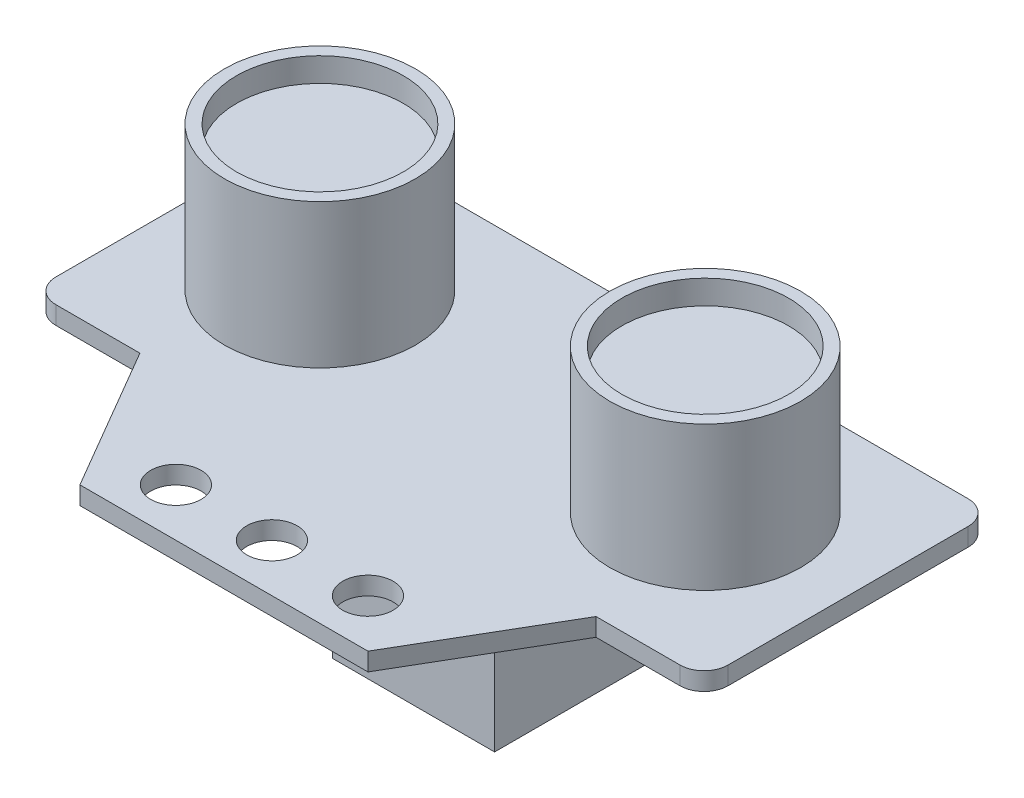
ISO-10303-21;
HEADER;
FILE_DESCRIPTION(('STEP AP214'),'2;1');
FILE_NAME('part.step','',(''),(''),'','','');
FILE_SCHEMA(('AUTOMOTIVE_DESIGN { 1 0 10303 214 1 1 1 1 }'));
ENDSEC;
DATA;
#1=APPLICATION_CONTEXT('core data for automotive mechanical design processes');
#2=APPLICATION_PROTOCOL_DEFINITION('international standard','automotive_design',2000,#1);
#3=PRODUCT_CONTEXT('',#1,'mechanical');
#4=PRODUCT('Part','Part','',(#3));
#5=PRODUCT_RELATED_PRODUCT_CATEGORY('part','',(#4));
#6=PRODUCT_DEFINITION_FORMATION('','',#4);
#7=PRODUCT_DEFINITION_CONTEXT('part definition',#1,'design');
#8=PRODUCT_DEFINITION('design','',#6,#7);
#9=PRODUCT_DEFINITION_SHAPE('','',#8);
#10=(LENGTH_UNIT() NAMED_UNIT(*) SI_UNIT(.MILLI.,.METRE.));
#11=(NAMED_UNIT(*) PLANE_ANGLE_UNIT() SI_UNIT($,.RADIAN.));
#12=(NAMED_UNIT(*) SI_UNIT($,.STERADIAN.) SOLID_ANGLE_UNIT());
#13=UNCERTAINTY_MEASURE_WITH_UNIT(LENGTH_MEASURE(1.E-05),#10,'distance_accuracy_value','');
#14=(GEOMETRIC_REPRESENTATION_CONTEXT(3) GLOBAL_UNCERTAINTY_ASSIGNED_CONTEXT((#13)) GLOBAL_UNIT_ASSIGNED_CONTEXT((#10,
#11,#12)) REPRESENTATION_CONTEXT('',''));
#15=CARTESIAN_POINT('',(0.,0.,0.));
#16=DIRECTION('',(0.,0.,1.));
#17=DIRECTION('',(1.,0.,0.));
#18=AXIS2_PLACEMENT_3D('',#15,#16,#17);
#19=CARTESIAN_POINT('',(0.,0.,0.));
#20=DIRECTION('',(0.,-1.,0.));
#21=DIRECTION('',(0.,0.,-1.));
#22=AXIS2_PLACEMENT_3D('',#19,#20,#21);
#23=PLANE('',#22);
#24=CARTESIAN_POINT('',(-8.,0.,-4.));
#25=DIRECTION('',(0.,1.,0.));
#26=DIRECTION('',(0.,0.,1.));
#27=AXIS2_PLACEMENT_3D('',#24,#25,#26);
#28=CIRCLE('',#27,2.1);
#29=CARTESIAN_POINT('',(-8.,0.,-1.9));
#30=VERTEX_POINT('',#29);
#31=EDGE_CURVE('E188',#30,#30,#28,.T.);
#32=ORIENTED_EDGE('',*,*,#31,.T.);
#33=EDGE_LOOP('',(#32));
#34=FACE_BOUND('',#33,.T.);
#35=DIRECTION('',(0.,0.,-1.));
#36=VECTOR('',#35,1.);
#37=CARTESIAN_POINT('',(28.,0.,-12.));
#38=LINE('',#37,#36);
#39=CARTESIAN_POINT('',(28.,0.,-14.));
#40=VERTEX_POINT('',#39);
#41=CARTESIAN_POINT('',(28.,0.,-34.));
#42=VERTEX_POINT('',#41);
#43=EDGE_CURVE('E234',#40,#42,#38,.T.);
#44=ORIENTED_EDGE('',*,*,#43,.F.);
#45=CARTESIAN_POINT('',(26.,0.,-14.));
#46=DIRECTION('',(0.,-1.,0.));
#47=DIRECTION('',(0.,0.,-1.));
#48=AXIS2_PLACEMENT_3D('',#45,#46,#47);
#49=CIRCLE('',#48,2.);
#50=CARTESIAN_POINT('',(26.,0.,-12.));
#51=VERTEX_POINT('',#50);
#52=EDGE_CURVE('E266',#40,#51,#49,.T.);
#53=ORIENTED_EDGE('',*,*,#52,.T.);
#54=DIRECTION('',(1.,0.,0.));
#55=VECTOR('',#54,1.);
#56=CARTESIAN_POINT('',(19.,0.,-12.));
#57=LINE('',#56,#55);
#58=CARTESIAN_POINT('',(19.,0.,-12.));
#59=VERTEX_POINT('',#58);
#60=EDGE_CURVE('E231',#59,#51,#57,.T.);
#61=ORIENTED_EDGE('',*,*,#60,.F.);
#62=DIRECTION('',(0.503871025524086,0.,-0.863778900898433));
#63=VECTOR('',#62,1.);
#64=CARTESIAN_POINT('',(12.,0.,0.));
#65=LINE('',#64,#63);
#66=CARTESIAN_POINT('',(12.,0.,0.));
#67=VERTEX_POINT('',#66);
#68=EDGE_CURVE('E229',#67,#59,#65,.T.);
#69=ORIENTED_EDGE('',*,*,#68,.F.);
#70=DIRECTION('',(1.,0.,0.));
#71=VECTOR('',#70,1.);
#72=CARTESIAN_POINT('',(12.,0.,0.));
#73=LINE('',#72,#71);
#74=CARTESIAN_POINT('',(-12.,0.,0.));
#75=VERTEX_POINT('',#74);
#76=EDGE_CURVE('E227',#75,#67,#73,.T.);
#77=ORIENTED_EDGE('',*,*,#76,.F.);
#78=DIRECTION('',(0.503871025524086,0.,0.863778900898433));
#79=VECTOR('',#78,1.);
#80=CARTESIAN_POINT('',(-12.,0.,0.));
#81=LINE('',#80,#79);
#82=CARTESIAN_POINT('',(-19.,0.,-12.));
#83=VERTEX_POINT('',#82);
#84=EDGE_CURVE('E200',#83,#75,#81,.T.);
#85=ORIENTED_EDGE('',*,*,#84,.F.);
#86=DIRECTION('',(1.,0.,0.));
#87=VECTOR('',#86,1.);
#88=CARTESIAN_POINT('',(-19.,0.,-12.));
#89=LINE('',#88,#87);
#90=CARTESIAN_POINT('',(-26.,0.,-12.));
#91=VERTEX_POINT('',#90);
#92=EDGE_CURVE('E207',#91,#83,#89,.T.);
#93=ORIENTED_EDGE('',*,*,#92,.F.);
#94=CARTESIAN_POINT('',(-26.,0.,-14.));
#95=DIRECTION('',(0.,-1.,0.));
#96=DIRECTION('',(0.,0.,-1.));
#97=AXIS2_PLACEMENT_3D('',#94,#95,#96);
#98=CIRCLE('',#97,2.);
#99=CARTESIAN_POINT('',(-28.,0.,-14.));
#100=VERTEX_POINT('',#99);
#101=EDGE_CURVE('E260',#91,#100,#98,.T.);
#102=ORIENTED_EDGE('',*,*,#101,.T.);
#103=DIRECTION('',(0.,0.,1.));
#104=VECTOR('',#103,1.);
#105=CARTESIAN_POINT('',(-28.,0.,-12.));
#106=LINE('',#105,#104);
#107=CARTESIAN_POINT('',(-28.,0.,-34.));
#108=VERTEX_POINT('',#107);
#109=EDGE_CURVE('E240',#108,#100,#106,.T.);
#110=ORIENTED_EDGE('',*,*,#109,.F.);
#111=CARTESIAN_POINT('',(-26.,0.,-34.));
#112=DIRECTION('',(0.,-1.,0.));
#113=DIRECTION('',(0.,0.,-1.));
#114=AXIS2_PLACEMENT_3D('',#111,#112,#113);
#115=CIRCLE('',#114,2.);
#116=CARTESIAN_POINT('',(-26.,0.,-36.));
#117=VERTEX_POINT('',#116);
#118=EDGE_CURVE('E262',#108,#117,#115,.T.);
#119=ORIENTED_EDGE('',*,*,#118,.T.);
#120=DIRECTION('',(-1.,0.,0.));
#121=VECTOR('',#120,1.);
#122=CARTESIAN_POINT('',(-28.,0.,-36.));
#123=LINE('',#122,#121);
#124=CARTESIAN_POINT('',(26.,0.,-36.));
#125=VERTEX_POINT('',#124);
#126=EDGE_CURVE('E237',#125,#117,#123,.T.);
#127=ORIENTED_EDGE('',*,*,#126,.F.);
#128=CARTESIAN_POINT('',(26.,0.,-34.));
#129=DIRECTION('',(0.,-1.,0.));
#130=DIRECTION('',(0.,0.,-1.));
#131=AXIS2_PLACEMENT_3D('',#128,#129,#130);
#132=CIRCLE('',#131,2.);
#133=EDGE_CURVE('E264',#125,#42,#132,.T.);
#134=ORIENTED_EDGE('',*,*,#133,.T.);
#135=EDGE_LOOP('',(#44,#53,#61,#69,#77,#85,#93,#102,#110,#119,#127,#134));
#136=FACE_BOUND('',#135,.T.);
#137=CARTESIAN_POINT('',(0.,0.,-4.));
#138=DIRECTION('',(0.,1.,0.));
#139=DIRECTION('',(0.,0.,1.));
#140=AXIS2_PLACEMENT_3D('',#137,#138,#139);
#141=CIRCLE('',#140,2.1);
#142=CARTESIAN_POINT('',(0.,0.,-1.9));
#143=VERTEX_POINT('',#142);
#144=EDGE_CURVE('E194',#143,#143,#141,.T.);
#145=ORIENTED_EDGE('',*,*,#144,.T.);
#146=EDGE_LOOP('',(#145));
#147=FACE_BOUND('',#146,.T.);
#148=CARTESIAN_POINT('',(8.,0.,-4.));
#149=DIRECTION('',(0.,1.,0.));
#150=DIRECTION('',(0.,0.,1.));
#151=AXIS2_PLACEMENT_3D('',#148,#149,#150);
#152=CIRCLE('',#151,2.1);
#153=CARTESIAN_POINT('',(8.,0.,-1.9));
#154=VERTEX_POINT('',#153);
#155=EDGE_CURVE('E184',#154,#154,#152,.T.);
#156=ORIENTED_EDGE('',*,*,#155,.T.);
#157=EDGE_LOOP('',(#156));
#158=FACE_BOUND('',#157,.T.);
#159=DIRECTION('',(1.,0.,0.));
#160=VECTOR('',#159,1.);
#161=CARTESIAN_POINT('',(-6.75,0.,-31.8));
#162=LINE('',#161,#160);
#163=CARTESIAN_POINT('',(-6.75,0.,-31.8));
#164=VERTEX_POINT('',#163);
#165=CARTESIAN_POINT('',(6.75,0.,-31.8));
#166=VERTEX_POINT('',#165);
#167=EDGE_CURVE('E321',#164,#166,#162,.T.);
#168=ORIENTED_EDGE('',*,*,#167,.F.);
#169=DIRECTION('',(0.,0.,-1.));
#170=VECTOR('',#169,1.);
#171=CARTESIAN_POINT('',(-6.75,0.,-15.8));
#172=LINE('',#171,#170);
#173=CARTESIAN_POINT('',(-6.75,0.,-15.8));
#174=VERTEX_POINT('',#173);
#175=EDGE_CURVE('E172',#174,#164,#172,.T.);
#176=ORIENTED_EDGE('',*,*,#175,.F.);
#177=DIRECTION('',(-1.,0.,0.));
#178=VECTOR('',#177,1.);
#179=CARTESIAN_POINT('',(-6.75,0.,-15.8));
#180=LINE('',#179,#178);
#181=CARTESIAN_POINT('',(6.75,0.,-15.8));
#182=VERTEX_POINT('',#181);
#183=EDGE_CURVE('E168',#182,#174,#180,.T.);
#184=ORIENTED_EDGE('',*,*,#183,.F.);
#185=DIRECTION('',(0.,0.,1.));
#186=VECTOR('',#185,1.);
#187=CARTESIAN_POINT('',(6.75,0.,-15.8));
#188=LINE('',#187,#186);
#189=EDGE_CURVE('E323',#166,#182,#188,.T.);
#190=ORIENTED_EDGE('',*,*,#189,.F.);
#191=EDGE_LOOP('',(#168,#176,#184,#190));
#192=FACE_BOUND('',#191,.T.);
#193=ADVANCED_FACE('F35',(#34,#136,#147,#158,#192),#23,.T.);
#194=CARTESIAN_POINT('',(0.,1.5,0.));
#195=DIRECTION('',(0.,-1.,0.));
#196=DIRECTION('',(0.,0.,-1.));
#197=AXIS2_PLACEMENT_3D('',#194,#195,#196);
#198=PLANE('',#197);
#199=CARTESIAN_POINT('',(16.05,1.5,-24.05));
#200=DIRECTION('',(0.,-1.,0.));
#201=DIRECTION('',(0.,0.,-1.));
#202=AXIS2_PLACEMENT_3D('',#199,#200,#201);
#203=CIRCLE('',#202,7.95);
#204=CARTESIAN_POINT('',(16.05,1.5,-32.));
#205=VERTEX_POINT('',#204);
#206=EDGE_CURVE('E11',#205,#205,#203,.F.);
#207=ORIENTED_EDGE('',*,*,#206,.F.);
#208=EDGE_LOOP('',(#207));
#209=FACE_BOUND('',#208,.T.);
#210=CARTESIAN_POINT('',(-16.05,1.5,-24.05));
#211=DIRECTION('',(0.,-1.,0.));
#212=DIRECTION('',(0.,0.,-1.));
#213=AXIS2_PLACEMENT_3D('',#210,#211,#212);
#214=CIRCLE('',#213,7.95);
#215=CARTESIAN_POINT('',(-16.05,1.5,-32.));
#216=VERTEX_POINT('',#215);
#217=EDGE_CURVE('E43',#216,#216,#214,.F.);
#218=ORIENTED_EDGE('',*,*,#217,.F.);
#219=EDGE_LOOP('',(#218));
#220=FACE_BOUND('',#219,.T.);
#221=DIRECTION('',(1.,0.,0.));
#222=VECTOR('',#221,1.);
#223=CARTESIAN_POINT('',(19.,1.5,-12.));
#224=LINE('',#223,#222);
#225=CARTESIAN_POINT('',(19.,1.5,-12.));
#226=VERTEX_POINT('',#225);
#227=CARTESIAN_POINT('',(26.,1.5,-12.));
#228=VERTEX_POINT('',#227);
#229=EDGE_CURVE('E211',#226,#228,#224,.T.);
#230=ORIENTED_EDGE('',*,*,#229,.T.);
#231=CARTESIAN_POINT('',(26.,1.5,-14.));
#232=DIRECTION('',(0.,-1.,0.));
#233=DIRECTION('',(0.,0.,-1.));
#234=AXIS2_PLACEMENT_3D('',#231,#232,#233);
#235=CIRCLE('',#234,2.);
#236=CARTESIAN_POINT('',(28.,1.5,-14.));
#237=VERTEX_POINT('',#236);
#238=EDGE_CURVE('E275',#228,#237,#235,.F.);
#239=ORIENTED_EDGE('',*,*,#238,.T.);
#240=DIRECTION('',(0.,0.,-1.));
#241=VECTOR('',#240,1.);
#242=CARTESIAN_POINT('',(28.,1.5,-12.));
#243=LINE('',#242,#241);
#244=CARTESIAN_POINT('',(28.,1.5,-34.));
#245=VERTEX_POINT('',#244);
#246=EDGE_CURVE('E214',#237,#245,#243,.T.);
#247=ORIENTED_EDGE('',*,*,#246,.T.);
#248=CARTESIAN_POINT('',(26.,1.5,-34.));
#249=DIRECTION('',(0.,-1.,0.));
#250=DIRECTION('',(0.,0.,-1.));
#251=AXIS2_PLACEMENT_3D('',#248,#249,#250);
#252=CIRCLE('',#251,2.);
#253=CARTESIAN_POINT('',(26.,1.5,-36.));
#254=VERTEX_POINT('',#253);
#255=EDGE_CURVE('E273',#245,#254,#252,.F.);
#256=ORIENTED_EDGE('',*,*,#255,.T.);
#257=DIRECTION('',(-1.,0.,0.));
#258=VECTOR('',#257,1.);
#259=CARTESIAN_POINT('',(-28.,1.5,-36.));
#260=LINE('',#259,#258);
#261=CARTESIAN_POINT('',(-26.,1.5,-36.));
#262=VERTEX_POINT('',#261);
#263=EDGE_CURVE('E217',#254,#262,#260,.T.);
#264=ORIENTED_EDGE('',*,*,#263,.T.);
#265=CARTESIAN_POINT('',(-26.,1.5,-34.));
#266=DIRECTION('',(0.,-1.,0.));
#267=DIRECTION('',(0.,0.,-1.));
#268=AXIS2_PLACEMENT_3D('',#265,#266,#267);
#269=CIRCLE('',#268,2.);
#270=CARTESIAN_POINT('',(-28.,1.5,-34.));
#271=VERTEX_POINT('',#270);
#272=EDGE_CURVE('E271',#262,#271,#269,.F.);
#273=ORIENTED_EDGE('',*,*,#272,.T.);
#274=DIRECTION('',(0.,0.,1.));
#275=VECTOR('',#274,1.);
#276=CARTESIAN_POINT('',(-28.,1.5,-12.));
#277=LINE('',#276,#275);
#278=CARTESIAN_POINT('',(-28.,1.5,-14.));
#279=VERTEX_POINT('',#278);
#280=EDGE_CURVE('E220',#271,#279,#277,.T.);
#281=ORIENTED_EDGE('',*,*,#280,.T.);
#282=CARTESIAN_POINT('',(-26.,1.5,-14.));
#283=DIRECTION('',(0.,-1.,0.));
#284=DIRECTION('',(0.,0.,-1.));
#285=AXIS2_PLACEMENT_3D('',#282,#283,#284);
#286=CIRCLE('',#285,2.);
#287=CARTESIAN_POINT('',(-26.,1.5,-12.));
#288=VERTEX_POINT('',#287);
#289=EDGE_CURVE('E58',#279,#288,#286,.F.);
#290=ORIENTED_EDGE('',*,*,#289,.T.);
#291=DIRECTION('',(1.,0.,0.));
#292=VECTOR('',#291,1.);
#293=CARTESIAN_POINT('',(-19.,1.5,-12.));
#294=LINE('',#293,#292);
#295=CARTESIAN_POINT('',(-19.,1.5,-12.));
#296=VERTEX_POINT('',#295);
#297=EDGE_CURVE('E222',#288,#296,#294,.T.);
#298=ORIENTED_EDGE('',*,*,#297,.T.);
#299=DIRECTION('',(0.503871025524086,0.,0.863778900898433));
#300=VECTOR('',#299,1.);
#301=CARTESIAN_POINT('',(-12.,1.5,0.));
#302=LINE('',#301,#300);
#303=CARTESIAN_POINT('',(-12.,1.5,0.));
#304=VERTEX_POINT('',#303);
#305=EDGE_CURVE('E203',#296,#304,#302,.T.);
#306=ORIENTED_EDGE('',*,*,#305,.T.);
#307=DIRECTION('',(1.,0.,0.));
#308=VECTOR('',#307,1.);
#309=CARTESIAN_POINT('',(12.,1.5,0.));
#310=LINE('',#309,#308);
#311=CARTESIAN_POINT('',(12.,1.5,0.));
#312=VERTEX_POINT('',#311);
#313=EDGE_CURVE('E206',#304,#312,#310,.T.);
#314=ORIENTED_EDGE('',*,*,#313,.T.);
#315=DIRECTION('',(0.503871025524086,0.,-0.863778900898433));
#316=VECTOR('',#315,1.);
#317=CARTESIAN_POINT('',(12.,1.5,0.));
#318=LINE('',#317,#316);
#319=EDGE_CURVE('E209',#312,#226,#318,.T.);
#320=ORIENTED_EDGE('',*,*,#319,.T.);
#321=EDGE_LOOP('',(#230,#239,#247,#256,#264,#273,#281,#290,#298,#306,#314,#320));
#322=FACE_BOUND('',#321,.T.);
#323=CARTESIAN_POINT('',(0.,1.5,-4.));
#324=DIRECTION('',(0.,1.,0.));
#325=DIRECTION('',(0.,0.,1.));
#326=AXIS2_PLACEMENT_3D('',#323,#324,#325);
#327=CIRCLE('',#326,2.1);
#328=CARTESIAN_POINT('',(0.,1.5,-1.9));
#329=VERTEX_POINT('',#328);
#330=EDGE_CURVE('E197',#329,#329,#327,.T.);
#331=ORIENTED_EDGE('',*,*,#330,.F.);
#332=EDGE_LOOP('',(#331));
#333=FACE_BOUND('',#332,.T.);
#334=CARTESIAN_POINT('',(-8.,1.5,-4.));
#335=DIRECTION('',(0.,1.,0.));
#336=DIRECTION('',(0.,0.,1.));
#337=AXIS2_PLACEMENT_3D('',#334,#335,#336);
#338=CIRCLE('',#337,2.1);
#339=CARTESIAN_POINT('',(-8.,1.5,-1.9));
#340=VERTEX_POINT('',#339);
#341=EDGE_CURVE('E191',#340,#340,#338,.T.);
#342=ORIENTED_EDGE('',*,*,#341,.F.);
#343=EDGE_LOOP('',(#342));
#344=FACE_BOUND('',#343,.T.);
#345=CARTESIAN_POINT('',(8.,1.5,-4.));
#346=DIRECTION('',(0.,1.,0.));
#347=DIRECTION('',(0.,0.,1.));
#348=AXIS2_PLACEMENT_3D('',#345,#346,#347);
#349=CIRCLE('',#348,2.1);
#350=CARTESIAN_POINT('',(8.,1.5,-1.9));
#351=VERTEX_POINT('',#350);
#352=EDGE_CURVE('E185',#351,#351,#349,.T.);
#353=ORIENTED_EDGE('',*,*,#352,.F.);
#354=EDGE_LOOP('',(#353));
#355=FACE_BOUND('',#354,.T.);
#356=ADVANCED_FACE('F294',(#209,#220,#322,#333,#344,#355),#198,.F.);
#357=CARTESIAN_POINT('',(-12.,1.5,0.));
#358=DIRECTION('',(0.863778900898433,0.,-0.503871025524086));
#359=DIRECTION('',(-0.503871025524086,0.,-0.863778900898433));
#360=AXIS2_PLACEMENT_3D('',#357,#358,#359);
#361=PLANE('',#360);
#362=ORIENTED_EDGE('',*,*,#84,.T.);
#363=DIRECTION('',(0.,-1.,0.));
#364=VECTOR('',#363,1.);
#365=CARTESIAN_POINT('',(-12.,1.5,0.));
#366=LINE('',#365,#364);
#367=EDGE_CURVE('E252',#304,#75,#366,.T.);
#368=ORIENTED_EDGE('',*,*,#367,.F.);
#369=ORIENTED_EDGE('',*,*,#305,.F.);
#370=DIRECTION('',(0.,-1.,0.));
#371=VECTOR('',#370,1.);
#372=CARTESIAN_POINT('',(-19.,1.5,-12.));
#373=LINE('',#372,#371);
#374=EDGE_CURVE('E224',#296,#83,#373,.T.);
#375=ORIENTED_EDGE('',*,*,#374,.T.);
#376=EDGE_LOOP('',(#362,#368,#369,#375));
#377=FACE_BOUND('',#376,.T.);
#378=ADVANCED_FACE('F296',(#377),#361,.F.);
#379=CARTESIAN_POINT('',(12.,1.5,0.));
#380=DIRECTION('',(0.,0.,-1.));
#381=DIRECTION('',(-1.,0.,0.));
#382=AXIS2_PLACEMENT_3D('',#379,#380,#381);
#383=PLANE('',#382);
#384=ORIENTED_EDGE('',*,*,#76,.T.);
#385=DIRECTION('',(0.,-1.,0.));
#386=VECTOR('',#385,1.);
#387=CARTESIAN_POINT('',(12.,1.5,0.));
#388=LINE('',#387,#386);
#389=EDGE_CURVE('E249',#312,#67,#388,.T.);
#390=ORIENTED_EDGE('',*,*,#389,.F.);
#391=ORIENTED_EDGE('',*,*,#313,.F.);
#392=ORIENTED_EDGE('',*,*,#367,.T.);
#393=EDGE_LOOP('',(#384,#390,#391,#392));
#394=FACE_BOUND('',#393,.T.);
#395=ADVANCED_FACE('F401',(#394),#383,.F.);
#396=CARTESIAN_POINT('',(12.,1.5,0.));
#397=DIRECTION('',(-0.863778900898433,0.,-0.503871025524086));
#398=DIRECTION('',(-0.503871025524086,0.,0.863778900898433));
#399=AXIS2_PLACEMENT_3D('',#396,#397,#398);
#400=PLANE('',#399);
#401=ORIENTED_EDGE('',*,*,#68,.T.);
#402=DIRECTION('',(0.,-1.,0.));
#403=VECTOR('',#402,1.);
#404=CARTESIAN_POINT('',(19.,1.5,-12.));
#405=LINE('',#404,#403);
#406=EDGE_CURVE('E246',#226,#59,#405,.T.);
#407=ORIENTED_EDGE('',*,*,#406,.F.);
#408=ORIENTED_EDGE('',*,*,#319,.F.);
#409=ORIENTED_EDGE('',*,*,#389,.T.);
#410=EDGE_LOOP('',(#401,#407,#408,#409));
#411=FACE_BOUND('',#410,.T.);
#412=ADVANCED_FACE('F397',(#411),#400,.F.);
#413=CARTESIAN_POINT('',(19.,1.5,-12.));
#414=DIRECTION('',(0.,0.,-1.));
#415=DIRECTION('',(-1.,0.,0.));
#416=AXIS2_PLACEMENT_3D('',#413,#414,#415);
#417=PLANE('',#416);
#418=ORIENTED_EDGE('',*,*,#60,.T.);
#419=DIRECTION('',(0.,-1.,0.));
#420=VECTOR('',#419,1.);
#421=CARTESIAN_POINT('',(26.,1.5,-12.));
#422=LINE('',#421,#420);
#423=EDGE_CURVE('E268',#51,#228,#422,.F.);
#424=ORIENTED_EDGE('',*,*,#423,.T.);
#425=ORIENTED_EDGE('',*,*,#229,.F.);
#426=ORIENTED_EDGE('',*,*,#406,.T.);
#427=EDGE_LOOP('',(#418,#424,#425,#426));
#428=FACE_BOUND('',#427,.T.);
#429=ADVANCED_FACE('F393',(#428),#417,.F.);
#430=CARTESIAN_POINT('',(28.,1.5,-12.));
#431=DIRECTION('',(-1.,0.,0.));
#432=DIRECTION('',(0.,0.,1.));
#433=AXIS2_PLACEMENT_3D('',#430,#431,#432);
#434=PLANE('',#433);
#435=ORIENTED_EDGE('',*,*,#246,.F.);
#436=DIRECTION('',(0.,-1.,0.));
#437=VECTOR('',#436,1.);
#438=CARTESIAN_POINT('',(28.,1.5,-14.));
#439=LINE('',#438,#437);
#440=EDGE_CURVE('E257',#237,#40,#439,.T.);
#441=ORIENTED_EDGE('',*,*,#440,.T.);
#442=ORIENTED_EDGE('',*,*,#43,.T.);
#443=DIRECTION('',(0.,-1.,0.));
#444=VECTOR('',#443,1.);
#445=CARTESIAN_POINT('',(28.,1.5,-34.));
#446=LINE('',#445,#444);
#447=EDGE_CURVE('E255',#42,#245,#446,.F.);
#448=ORIENTED_EDGE('',*,*,#447,.T.);
#449=EDGE_LOOP('',(#435,#441,#442,#448));
#450=FACE_BOUND('',#449,.T.);
#451=ADVANCED_FACE('F389',(#450),#434,.F.);
#452=CARTESIAN_POINT('',(-28.,1.5,-36.));
#453=DIRECTION('',(0.,0.,1.));
#454=DIRECTION('',(1.,0.,0.));
#455=AXIS2_PLACEMENT_3D('',#452,#453,#454);
#456=PLANE('',#455);
#457=ORIENTED_EDGE('',*,*,#263,.F.);
#458=DIRECTION('',(0.,-1.,0.));
#459=VECTOR('',#458,1.);
#460=CARTESIAN_POINT('',(26.,1.5,-36.));
#461=LINE('',#460,#459);
#462=EDGE_CURVE('E279',#254,#125,#461,.T.);
#463=ORIENTED_EDGE('',*,*,#462,.T.);
#464=ORIENTED_EDGE('',*,*,#126,.T.);
#465=DIRECTION('',(0.,-1.,0.));
#466=VECTOR('',#465,1.);
#467=CARTESIAN_POINT('',(-26.,1.5,-36.));
#468=LINE('',#467,#466);
#469=EDGE_CURVE('E277',#117,#262,#468,.F.);
#470=ORIENTED_EDGE('',*,*,#469,.T.);
#471=EDGE_LOOP('',(#457,#463,#464,#470));
#472=FACE_BOUND('',#471,.T.);
#473=ADVANCED_FACE('F385',(#472),#456,.F.);
#474=CARTESIAN_POINT('',(-28.,1.5,-12.));
#475=DIRECTION('',(1.,0.,0.));
#476=DIRECTION('',(0.,0.,-1.));
#477=AXIS2_PLACEMENT_3D('',#474,#475,#476);
#478=PLANE('',#477);
#479=ORIENTED_EDGE('',*,*,#280,.F.);
#480=DIRECTION('',(0.,-1.,0.));
#481=VECTOR('',#480,1.);
#482=CARTESIAN_POINT('',(-28.,1.5,-34.));
#483=LINE('',#482,#481);
#484=EDGE_CURVE('E284',#271,#108,#483,.T.);
#485=ORIENTED_EDGE('',*,*,#484,.T.);
#486=ORIENTED_EDGE('',*,*,#109,.T.);
#487=DIRECTION('',(0.,-1.,0.));
#488=VECTOR('',#487,1.);
#489=CARTESIAN_POINT('',(-28.,1.5,-14.));
#490=LINE('',#489,#488);
#491=EDGE_CURVE('E282',#100,#279,#490,.F.);
#492=ORIENTED_EDGE('',*,*,#491,.T.);
#493=EDGE_LOOP('',(#479,#485,#486,#492));
#494=FACE_BOUND('',#493,.T.);
#495=ADVANCED_FACE('F381',(#494),#478,.F.);
#496=CARTESIAN_POINT('',(-19.,1.5,-12.));
#497=DIRECTION('',(0.,0.,-1.));
#498=DIRECTION('',(-1.,0.,0.));
#499=AXIS2_PLACEMENT_3D('',#496,#497,#498);
#500=PLANE('',#499);
#501=ORIENTED_EDGE('',*,*,#297,.F.);
#502=DIRECTION('',(0.,-1.,0.));
#503=VECTOR('',#502,1.);
#504=CARTESIAN_POINT('',(-26.,1.5,-12.));
#505=LINE('',#504,#503);
#506=EDGE_CURVE('E287',#288,#91,#505,.T.);
#507=ORIENTED_EDGE('',*,*,#506,.T.);
#508=ORIENTED_EDGE('',*,*,#92,.T.);
#509=ORIENTED_EDGE('',*,*,#374,.F.);
#510=EDGE_LOOP('',(#501,#507,#508,#509));
#511=FACE_BOUND('',#510,.T.);
#512=ADVANCED_FACE('F376',(#511),#500,.F.);
#513=CARTESIAN_POINT('',(0.,1.5,-4.));
#514=DIRECTION('',(0.,-1.,0.));
#515=DIRECTION('',(0.,0.,-1.));
#516=AXIS2_PLACEMENT_3D('',#513,#514,#515);
#517=CYLINDRICAL_SURFACE('',#516,2.1);
#518=ORIENTED_EDGE('',*,*,#330,.T.);
#519=EDGE_LOOP('',(#518));
#520=FACE_BOUND('',#519,.T.);
#521=ORIENTED_EDGE('',*,*,#144,.F.);
#522=EDGE_LOOP('',(#521));
#523=FACE_BOUND('',#522,.T.);
#524=ADVANCED_FACE('F373',(#520,#523),#517,.F.);
#525=CARTESIAN_POINT('',(-8.,1.5,-4.));
#526=DIRECTION('',(0.,-1.,0.));
#527=DIRECTION('',(0.,0.,-1.));
#528=AXIS2_PLACEMENT_3D('',#525,#526,#527);
#529=CYLINDRICAL_SURFACE('',#528,2.1);
#530=ORIENTED_EDGE('',*,*,#341,.T.);
#531=EDGE_LOOP('',(#530));
#532=FACE_BOUND('',#531,.T.);
#533=ORIENTED_EDGE('',*,*,#31,.F.);
#534=EDGE_LOOP('',(#533));
#535=FACE_BOUND('',#534,.T.);
#536=ADVANCED_FACE('F312',(#532,#535),#529,.F.);
#537=CARTESIAN_POINT('',(8.,1.5,-4.));
#538=DIRECTION('',(0.,-1.,0.));
#539=DIRECTION('',(0.,0.,-1.));
#540=AXIS2_PLACEMENT_3D('',#537,#538,#539);
#541=CYLINDRICAL_SURFACE('',#540,2.1);
#542=ORIENTED_EDGE('',*,*,#352,.T.);
#543=EDGE_LOOP('',(#542));
#544=FACE_BOUND('',#543,.T.);
#545=ORIENTED_EDGE('',*,*,#155,.F.);
#546=EDGE_LOOP('',(#545));
#547=FACE_BOUND('',#546,.T.);
#548=ADVANCED_FACE('F308',(#544,#547),#541,.F.);
#549=CARTESIAN_POINT('',(26.,1.5,-14.));
#550=DIRECTION('',(0.,-1.,0.));
#551=DIRECTION('',(0.,0.,-1.));
#552=AXIS2_PLACEMENT_3D('',#549,#550,#551);
#553=CYLINDRICAL_SURFACE('',#552,2.);
#554=ORIENTED_EDGE('',*,*,#238,.F.);
#555=ORIENTED_EDGE('',*,*,#423,.F.);
#556=ORIENTED_EDGE('',*,*,#52,.F.);
#557=ORIENTED_EDGE('',*,*,#440,.F.);
#558=EDGE_LOOP('',(#554,#555,#556,#557));
#559=FACE_BOUND('',#558,.T.);
#560=ADVANCED_FACE('F311',(#559),#553,.T.);
#561=CARTESIAN_POINT('',(26.,1.5,-34.));
#562=DIRECTION('',(0.,-1.,0.));
#563=DIRECTION('',(0.,0.,-1.));
#564=AXIS2_PLACEMENT_3D('',#561,#562,#563);
#565=CYLINDRICAL_SURFACE('',#564,2.);
#566=ORIENTED_EDGE('',*,*,#255,.F.);
#567=ORIENTED_EDGE('',*,*,#447,.F.);
#568=ORIENTED_EDGE('',*,*,#133,.F.);
#569=ORIENTED_EDGE('',*,*,#462,.F.);
#570=EDGE_LOOP('',(#566,#567,#568,#569));
#571=FACE_BOUND('',#570,.T.);
#572=ADVANCED_FACE('F411',(#571),#565,.T.);
#573=CARTESIAN_POINT('',(-26.,1.5,-34.));
#574=DIRECTION('',(0.,-1.,0.));
#575=DIRECTION('',(0.,0.,-1.));
#576=AXIS2_PLACEMENT_3D('',#573,#574,#575);
#577=CYLINDRICAL_SURFACE('',#576,2.);
#578=ORIENTED_EDGE('',*,*,#272,.F.);
#579=ORIENTED_EDGE('',*,*,#469,.F.);
#580=ORIENTED_EDGE('',*,*,#118,.F.);
#581=ORIENTED_EDGE('',*,*,#484,.F.);
#582=EDGE_LOOP('',(#578,#579,#580,#581));
#583=FACE_BOUND('',#582,.T.);
#584=ADVANCED_FACE('F367',(#583),#577,.T.);
#585=CARTESIAN_POINT('',(-26.,1.5,-14.));
#586=DIRECTION('',(0.,-1.,0.));
#587=DIRECTION('',(0.,0.,-1.));
#588=AXIS2_PLACEMENT_3D('',#585,#586,#587);
#589=CYLINDRICAL_SURFACE('',#588,2.);
#590=ORIENTED_EDGE('',*,*,#289,.F.);
#591=ORIENTED_EDGE('',*,*,#491,.F.);
#592=ORIENTED_EDGE('',*,*,#101,.F.);
#593=ORIENTED_EDGE('',*,*,#506,.F.);
#594=EDGE_LOOP('',(#590,#591,#592,#593));
#595=FACE_BOUND('',#594,.T.);
#596=ADVANCED_FACE('F37',(#595),#589,.T.);
#597=CARTESIAN_POINT('',(-16.05,13.5,-24.05));
#598=DIRECTION('',(0.,-1.,0.));
#599=DIRECTION('',(0.,0.,-1.));
#600=AXIS2_PLACEMENT_3D('',#597,#598,#599);
#601=CYLINDRICAL_SURFACE('',#600,7.95);
#602=CARTESIAN_POINT('',(-16.05,13.5,-24.05));
#603=DIRECTION('',(0.,1.,0.));
#604=DIRECTION('',(0.,0.,1.));
#605=AXIS2_PLACEMENT_3D('',#602,#603,#604);
#606=CIRCLE('',#605,7.95);
#607=CARTESIAN_POINT('',(-16.05,13.5,-16.1));
#608=VERTEX_POINT('',#607);
#609=EDGE_CURVE('E177',#608,#608,#606,.T.);
#610=ORIENTED_EDGE('',*,*,#609,.F.);
#611=EDGE_LOOP('',(#610));
#612=FACE_BOUND('',#611,.T.);
#613=ORIENTED_EDGE('',*,*,#217,.T.);
#614=EDGE_LOOP('',(#613));
#615=FACE_BOUND('',#614,.T.);
#616=ADVANCED_FACE('F292',(#612,#615),#601,.T.);
#617=CARTESIAN_POINT('',(-16.05,13.5,-24.05));
#618=DIRECTION('',(0.,1.,0.));
#619=DIRECTION('',(0.,0.,1.));
#620=AXIS2_PLACEMENT_3D('',#617,#618,#619);
#621=PLANE('',#620);
#622=CARTESIAN_POINT('',(-16.05,13.5,-24.05));
#623=DIRECTION('',(0.,1.,0.));
#624=DIRECTION('',(0.,0.,1.));
#625=AXIS2_PLACEMENT_3D('',#622,#623,#624);
#626=CIRCLE('',#625,6.95);
#627=CARTESIAN_POINT('',(-16.05,13.5,-17.1));
#628=VERTEX_POINT('',#627);
#629=EDGE_CURVE('E340',#628,#628,#626,.T.);
#630=ORIENTED_EDGE('',*,*,#629,.F.);
#631=EDGE_LOOP('',(#630));
#632=FACE_BOUND('',#631,.T.);
#633=ORIENTED_EDGE('',*,*,#609,.T.);
#634=EDGE_LOOP('',(#633));
#635=FACE_BOUND('',#634,.T.);
#636=ADVANCED_FACE('F355',(#632,#635),#621,.T.);
#637=CARTESIAN_POINT('',(16.05,13.5,-24.05));
#638=DIRECTION('',(0.,-1.,0.));
#639=DIRECTION('',(0.,0.,-1.));
#640=AXIS2_PLACEMENT_3D('',#637,#638,#639);
#641=CYLINDRICAL_SURFACE('',#640,7.95);
#642=CARTESIAN_POINT('',(16.05,13.5,-24.05));
#643=DIRECTION('',(0.,1.,0.));
#644=DIRECTION('',(0.,0.,-1.));
#645=AXIS2_PLACEMENT_3D('',#642,#643,#644);
#646=CIRCLE('',#645,7.95);
#647=CARTESIAN_POINT('',(16.05,13.5,-32.));
#648=VERTEX_POINT('',#647);
#649=EDGE_CURVE('E174',#648,#648,#646,.T.);
#650=ORIENTED_EDGE('',*,*,#649,.F.);
#651=EDGE_LOOP('',(#650));
#652=FACE_BOUND('',#651,.T.);
#653=ORIENTED_EDGE('',*,*,#206,.T.);
#654=EDGE_LOOP('',(#653));
#655=FACE_BOUND('',#654,.T.);
#656=ADVANCED_FACE('F358',(#652,#655),#641,.T.);
#657=CARTESIAN_POINT('',(16.05,13.5,-24.05));
#658=DIRECTION('',(0.,-1.,0.));
#659=DIRECTION('',(0.,0.,-1.));
#660=AXIS2_PLACEMENT_3D('',#657,#658,#659);
#661=PLANE('',#660);
#662=CARTESIAN_POINT('',(16.05,13.5,-24.05));
#663=DIRECTION('',(0.,1.,0.));
#664=DIRECTION('',(0.,0.,1.));
#665=AXIS2_PLACEMENT_3D('',#662,#663,#664);
#666=CIRCLE('',#665,6.95);
#667=CARTESIAN_POINT('',(16.05,13.5,-17.1));
#668=VERTEX_POINT('',#667);
#669=EDGE_CURVE('E334',#668,#668,#666,.T.);
#670=ORIENTED_EDGE('',*,*,#669,.F.);
#671=EDGE_LOOP('',(#670));
#672=FACE_BOUND('',#671,.T.);
#673=ORIENTED_EDGE('',*,*,#649,.T.);
#674=EDGE_LOOP('',(#673));
#675=FACE_BOUND('',#674,.T.);
#676=ADVANCED_FACE('F476',(#672,#675),#661,.F.);
#677=CARTESIAN_POINT('',(-6.75,-16.3,-15.8));
#678=DIRECTION('',(1.,0.,0.));
#679=DIRECTION('',(0.,0.,-1.));
#680=AXIS2_PLACEMENT_3D('',#677,#678,#679);
#681=PLANE('',#680);
#682=ORIENTED_EDGE('',*,*,#175,.T.);
#683=DIRECTION('',(0.,1.,0.));
#684=VECTOR('',#683,1.);
#685=CARTESIAN_POINT('',(-6.75,-16.3,-31.8));
#686=LINE('',#685,#684);
#687=CARTESIAN_POINT('',(-6.75,-16.3,-31.8));
#688=VERTEX_POINT('',#687);
#689=EDGE_CURVE('E153',#688,#164,#686,.T.);
#690=ORIENTED_EDGE('',*,*,#689,.F.);
#691=DIRECTION('',(0.,0.,-1.));
#692=VECTOR('',#691,1.);
#693=CARTESIAN_POINT('',(-6.75,-16.3,-15.8));
#694=LINE('',#693,#692);
#695=CARTESIAN_POINT('',(-6.75,-16.3,-15.8));
#696=VERTEX_POINT('',#695);
#697=EDGE_CURVE('E160',#696,#688,#694,.T.);
#698=ORIENTED_EDGE('',*,*,#697,.F.);
#699=DIRECTION('',(0.,1.,0.));
#700=VECTOR('',#699,1.);
#701=CARTESIAN_POINT('',(-6.75,-16.3,-15.8));
#702=LINE('',#701,#700);
#703=EDGE_CURVE('E331',#696,#174,#702,.T.);
#704=ORIENTED_EDGE('',*,*,#703,.T.);
#705=EDGE_LOOP('',(#682,#690,#698,#704));
#706=FACE_BOUND('',#705,.T.);
#707=ADVANCED_FACE('F170',(#706),#681,.F.);
#708=CARTESIAN_POINT('',(-6.75,-16.3,-31.8));
#709=DIRECTION('',(0.,0.,1.));
#710=DIRECTION('',(1.,0.,0.));
#711=AXIS2_PLACEMENT_3D('',#708,#709,#710);
#712=PLANE('',#711);
#713=ORIENTED_EDGE('',*,*,#167,.T.);
#714=DIRECTION('',(0.,1.,0.));
#715=VECTOR('',#714,1.);
#716=CARTESIAN_POINT('',(6.75,-16.3,-31.8));
#717=LINE('',#716,#715);
#718=CARTESIAN_POINT('',(6.75,-16.3,-31.8));
#719=VERTEX_POINT('',#718);
#720=EDGE_CURVE('E156',#719,#166,#717,.T.);
#721=ORIENTED_EDGE('',*,*,#720,.F.);
#722=DIRECTION('',(1.,0.,0.));
#723=VECTOR('',#722,1.);
#724=CARTESIAN_POINT('',(-6.75,-16.3,-31.8));
#725=LINE('',#724,#723);
#726=EDGE_CURVE('E149',#688,#719,#725,.T.);
#727=ORIENTED_EDGE('',*,*,#726,.F.);
#728=ORIENTED_EDGE('',*,*,#689,.T.);
#729=EDGE_LOOP('',(#713,#721,#727,#728));
#730=FACE_BOUND('',#729,.T.);
#731=ADVANCED_FACE('F151',(#730),#712,.F.);
#732=CARTESIAN_POINT('',(6.75,-16.3,-15.8));
#733=DIRECTION('',(-1.,0.,0.));
#734=DIRECTION('',(0.,0.,1.));
#735=AXIS2_PLACEMENT_3D('',#732,#733,#734);
#736=PLANE('',#735);
#737=ORIENTED_EDGE('',*,*,#189,.T.);
#738=DIRECTION('',(0.,1.,0.));
#739=VECTOR('',#738,1.);
#740=CARTESIAN_POINT('',(6.75,-16.3,-15.8));
#741=LINE('',#740,#739);
#742=CARTESIAN_POINT('',(6.75,-16.3,-15.8));
#743=VERTEX_POINT('',#742);
#744=EDGE_CURVE('E50',#743,#182,#741,.T.);
#745=ORIENTED_EDGE('',*,*,#744,.F.);
#746=DIRECTION('',(0.,0.,1.));
#747=VECTOR('',#746,1.);
#748=CARTESIAN_POINT('',(6.75,-16.3,-15.8));
#749=LINE('',#748,#747);
#750=EDGE_CURVE('E159',#719,#743,#749,.T.);
#751=ORIENTED_EDGE('',*,*,#750,.F.);
#752=ORIENTED_EDGE('',*,*,#720,.T.);
#753=EDGE_LOOP('',(#737,#745,#751,#752));
#754=FACE_BOUND('',#753,.T.);
#755=ADVANCED_FACE('F501',(#754),#736,.F.);
#756=CARTESIAN_POINT('',(-6.75,-16.3,-15.8));
#757=DIRECTION('',(0.,0.,-1.));
#758=DIRECTION('',(-1.,0.,0.));
#759=AXIS2_PLACEMENT_3D('',#756,#757,#758);
#760=PLANE('',#759);
#761=ORIENTED_EDGE('',*,*,#183,.T.);
#762=ORIENTED_EDGE('',*,*,#703,.F.);
#763=DIRECTION('',(-1.,0.,0.));
#764=VECTOR('',#763,1.);
#765=CARTESIAN_POINT('',(-6.75,-16.3,-15.8));
#766=LINE('',#765,#764);
#767=EDGE_CURVE('E164',#743,#696,#766,.T.);
#768=ORIENTED_EDGE('',*,*,#767,.F.);
#769=ORIENTED_EDGE('',*,*,#744,.T.);
#770=EDGE_LOOP('',(#761,#762,#768,#769));
#771=FACE_BOUND('',#770,.T.);
#772=ADVANCED_FACE('F510',(#771),#760,.F.);
#773=CARTESIAN_POINT('',(0.,-16.3,0.));
#774=DIRECTION('',(0.,-1.,0.));
#775=DIRECTION('',(0.,0.,-1.));
#776=AXIS2_PLACEMENT_3D('',#773,#774,#775);
#777=PLANE('',#776);
#778=ORIENTED_EDGE('',*,*,#697,.T.);
#779=ORIENTED_EDGE('',*,*,#726,.T.);
#780=ORIENTED_EDGE('',*,*,#750,.T.);
#781=ORIENTED_EDGE('',*,*,#767,.T.);
#782=EDGE_LOOP('',(#778,#779,#780,#781));
#783=FACE_BOUND('',#782,.T.);
#784=ADVANCED_FACE('F163',(#783),#777,.T.);
#785=CARTESIAN_POINT('',(16.05,11.5,-24.05));
#786=DIRECTION('',(0.,1.,0.));
#787=DIRECTION('',(0.,0.,1.));
#788=AXIS2_PLACEMENT_3D('',#785,#786,#787);
#789=CYLINDRICAL_SURFACE('',#788,6.95);
#790=CARTESIAN_POINT('',(16.05,11.5,-24.05));
#791=DIRECTION('',(0.,1.,0.));
#792=DIRECTION('',(0.,0.,1.));
#793=AXIS2_PLACEMENT_3D('',#790,#791,#792);
#794=CIRCLE('',#793,6.95);
#795=CARTESIAN_POINT('',(16.05,11.5,-17.1));
#796=VERTEX_POINT('',#795);
#797=EDGE_CURVE('E337',#796,#796,#794,.T.);
#798=ORIENTED_EDGE('',*,*,#797,.F.);
#799=EDGE_LOOP('',(#798));
#800=FACE_BOUND('',#799,.T.);
#801=ORIENTED_EDGE('',*,*,#669,.T.);
#802=EDGE_LOOP('',(#801));
#803=FACE_BOUND('',#802,.T.);
#804=ADVANCED_FACE('F528',(#800,#803),#789,.F.);
#805=CARTESIAN_POINT('',(16.05,11.5,-24.05));
#806=DIRECTION('',(0.,1.,0.));
#807=DIRECTION('',(0.,0.,1.));
#808=AXIS2_PLACEMENT_3D('',#805,#806,#807);
#809=PLANE('',#808);
#810=ORIENTED_EDGE('',*,*,#797,.T.);
#811=EDGE_LOOP('',(#810));
#812=FACE_BOUND('',#811,.T.);
#813=ADVANCED_FACE('F351',(#812),#809,.T.);
#814=CARTESIAN_POINT('',(-16.05,11.5,-24.05));
#815=DIRECTION('',(0.,1.,0.));
#816=DIRECTION('',(0.,0.,1.));
#817=AXIS2_PLACEMENT_3D('',#814,#815,#816);
#818=CYLINDRICAL_SURFACE('',#817,6.95);
#819=CARTESIAN_POINT('',(-16.05,11.5,-24.05));
#820=DIRECTION('',(0.,1.,0.));
#821=DIRECTION('',(0.,0.,1.));
#822=AXIS2_PLACEMENT_3D('',#819,#820,#821);
#823=CIRCLE('',#822,6.95);
#824=CARTESIAN_POINT('',(-16.05,11.5,-17.1));
#825=VERTEX_POINT('',#824);
#826=EDGE_CURVE('E326',#825,#825,#823,.T.);
#827=ORIENTED_EDGE('',*,*,#826,.F.);
#828=EDGE_LOOP('',(#827));
#829=FACE_BOUND('',#828,.T.);
#830=ORIENTED_EDGE('',*,*,#629,.T.);
#831=EDGE_LOOP('',(#830));
#832=FACE_BOUND('',#831,.T.);
#833=ADVANCED_FACE('F348',(#829,#832),#818,.F.);
#834=CARTESIAN_POINT('',(-16.05,11.5,-24.05));
#835=DIRECTION('',(0.,1.,0.));
#836=DIRECTION('',(0.,0.,1.));
#837=AXIS2_PLACEMENT_3D('',#834,#835,#836);
#838=PLANE('',#837);
#839=ORIENTED_EDGE('',*,*,#826,.T.);
#840=EDGE_LOOP('',(#839));
#841=FACE_BOUND('',#840,.T.);
#842=ADVANCED_FACE('F346',(#841),#838,.T.);
#843=CLOSED_SHELL('',(#193,#356,#378,#395,#412,#429,#451,#473,#495,#512,#524,#536,#548,#560,
#572,#584,#596,#616,#636,#656,#676,#707,#731,#755,#772,#784,#804,#813,#833,#842));
#844=MANIFOLD_SOLID_BREP('B2',#843);
#845=ADVANCED_BREP_SHAPE_REPRESENTATION('',(#18,#844),#14);
#846=SHAPE_DEFINITION_REPRESENTATION(#9,#845);
ENDSEC;
END-ISO-10303-21;
